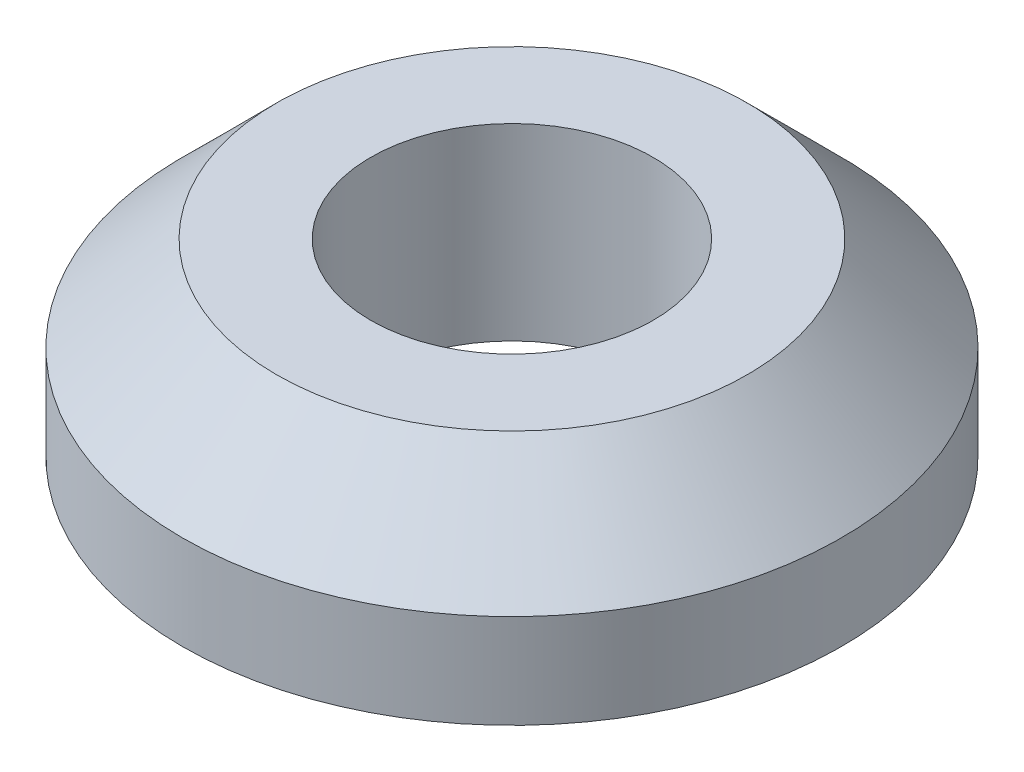
ISO-10303-21;
HEADER;
FILE_DESCRIPTION(('STEP AP214'),'2;1');
FILE_NAME('part.step','',(''),(''),'','','');
FILE_SCHEMA(('AUTOMOTIVE_DESIGN { 1 0 10303 214 1 1 1 1 }'));
ENDSEC;
DATA;
#1=APPLICATION_CONTEXT('core data for automotive mechanical design processes');
#2=APPLICATION_PROTOCOL_DEFINITION('international standard','automotive_design',2000,#1);
#3=PRODUCT_CONTEXT('',#1,'mechanical');
#4=PRODUCT('Part','Part','',(#3));
#5=PRODUCT_RELATED_PRODUCT_CATEGORY('part','',(#4));
#6=PRODUCT_DEFINITION_FORMATION('','',#4);
#7=PRODUCT_DEFINITION_CONTEXT('part definition',#1,'design');
#8=PRODUCT_DEFINITION('design','',#6,#7);
#9=PRODUCT_DEFINITION_SHAPE('','',#8);
#10=(LENGTH_UNIT() NAMED_UNIT(*) SI_UNIT(.MILLI.,.METRE.));
#11=(NAMED_UNIT(*) PLANE_ANGLE_UNIT() SI_UNIT($,.RADIAN.));
#12=(NAMED_UNIT(*) SI_UNIT($,.STERADIAN.) SOLID_ANGLE_UNIT());
#13=UNCERTAINTY_MEASURE_WITH_UNIT(LENGTH_MEASURE(1.E-05),#10,'distance_accuracy_value','');
#14=(GEOMETRIC_REPRESENTATION_CONTEXT(3) GLOBAL_UNCERTAINTY_ASSIGNED_CONTEXT((#13)) GLOBAL_UNIT_ASSIGNED_CONTEXT((#10,
#11,#12)) REPRESENTATION_CONTEXT('',''));
#15=CARTESIAN_POINT('',(0.,0.,0.));
#16=DIRECTION('',(0.,0.,1.));
#17=DIRECTION('',(1.,0.,0.));
#18=AXIS2_PLACEMENT_3D('',#15,#16,#17);
#19=CARTESIAN_POINT('',(0.,2.,0.));
#20=DIRECTION('',(0.,-1.,0.));
#21=DIRECTION('',(0.,0.,-1.));
#22=AXIS2_PLACEMENT_3D('',#19,#20,#21);
#23=CYLINDRICAL_SURFACE('',#22,3.5);
#24=CARTESIAN_POINT('',(0.,0.999999999999994,0.));
#25=DIRECTION('',(0.,1.,0.));
#26=DIRECTION('',(0.,0.,1.));
#27=AXIS2_PLACEMENT_3D('',#24,#25,#26);
#28=CIRCLE('',#27,3.5);
#29=CARTESIAN_POINT('',(0.,0.999999999999994,3.5));
#30=VERTEX_POINT('',#29);
#31=EDGE_CURVE('E10',#30,#30,#28,.F.);
#32=ORIENTED_EDGE('',*,*,#31,.T.);
#33=EDGE_LOOP('',(#32));
#34=FACE_BOUND('',#33,.T.);
#35=CARTESIAN_POINT('',(0.,0.,0.));
#36=DIRECTION('',(0.,1.,0.));
#37=DIRECTION('',(0.,0.,1.));
#38=AXIS2_PLACEMENT_3D('',#35,#36,#37);
#39=CIRCLE('',#38,3.5);
#40=CARTESIAN_POINT('',(0.,0.,3.5));
#41=VERTEX_POINT('',#40);
#42=EDGE_CURVE('E53',#41,#41,#39,.T.);
#43=ORIENTED_EDGE('',*,*,#42,.T.);
#44=EDGE_LOOP('',(#43));
#45=FACE_BOUND('',#44,.T.);
#46=ADVANCED_FACE('F39',(#34,#45),#23,.T.);
#47=CARTESIAN_POINT('',(0.,2.,0.));
#48=DIRECTION('',(0.,1.,0.));
#49=DIRECTION('',(0.,0.,1.));
#50=AXIS2_PLACEMENT_3D('',#47,#48,#49);
#51=PLANE('',#50);
#52=CARTESIAN_POINT('',(0.,2.,0.));
#53=DIRECTION('',(0.,1.,0.));
#54=DIRECTION('',(0.,0.,1.));
#55=AXIS2_PLACEMENT_3D('',#52,#53,#54);
#56=CIRCLE('',#55,1.5);
#57=CARTESIAN_POINT('',(0.,2.,1.5));
#58=VERTEX_POINT('',#57);
#59=EDGE_CURVE('E61',#58,#58,#56,.T.);
#60=ORIENTED_EDGE('',*,*,#59,.F.);
#61=EDGE_LOOP('',(#60));
#62=FACE_BOUND('',#61,.T.);
#63=CARTESIAN_POINT('',(0.,2.,0.));
#64=DIRECTION('',(0.,1.,0.));
#65=DIRECTION('',(0.,0.,1.));
#66=AXIS2_PLACEMENT_3D('',#63,#64,#65);
#67=CIRCLE('',#66,2.5);
#68=CARTESIAN_POINT('',(0.,2.,2.5));
#69=VERTEX_POINT('',#68);
#70=EDGE_CURVE('E48',#69,#69,#67,.T.);
#71=ORIENTED_EDGE('',*,*,#70,.T.);
#72=EDGE_LOOP('',(#71));
#73=FACE_BOUND('',#72,.T.);
#74=ADVANCED_FACE('F78',(#62,#73),#51,.T.);
#75=CARTESIAN_POINT('',(0.,0.,0.));
#76=DIRECTION('',(0.,1.,0.));
#77=DIRECTION('',(0.,0.,1.));
#78=AXIS2_PLACEMENT_3D('',#75,#76,#77);
#79=PLANE('',#78);
#80=CARTESIAN_POINT('',(0.,0.,0.));
#81=DIRECTION('',(0.,1.,0.));
#82=DIRECTION('',(0.,0.,1.));
#83=AXIS2_PLACEMENT_3D('',#80,#81,#82);
#84=CIRCLE('',#83,1.5);
#85=CARTESIAN_POINT('',(0.,0.,1.5));
#86=VERTEX_POINT('',#85);
#87=EDGE_CURVE('E58',#86,#86,#84,.T.);
#88=ORIENTED_EDGE('',*,*,#87,.T.);
#89=EDGE_LOOP('',(#88));
#90=FACE_BOUND('',#89,.T.);
#91=ORIENTED_EDGE('',*,*,#42,.F.);
#92=EDGE_LOOP('',(#91));
#93=FACE_BOUND('',#92,.T.);
#94=ADVANCED_FACE('F69',(#90,#93),#79,.F.);
#95=CARTESIAN_POINT('',(0.,2.,0.));
#96=DIRECTION('',(0.,-1.,0.));
#97=DIRECTION('',(0.,0.,-1.));
#98=AXIS2_PLACEMENT_3D('',#95,#96,#97);
#99=CONICAL_SURFACE('',#98,2.5,0.785398163397447);
#100=ORIENTED_EDGE('',*,*,#31,.F.);
#101=EDGE_LOOP('',(#100));
#102=FACE_BOUND('',#101,.T.);
#103=ORIENTED_EDGE('',*,*,#70,.F.);
#104=EDGE_LOOP('',(#103));
#105=FACE_BOUND('',#104,.T.);
#106=ADVANCED_FACE('F42',(#102,#105),#99,.T.);
#107=CARTESIAN_POINT('',(0.,0.,0.));
#108=DIRECTION('',(0.,1.,0.));
#109=DIRECTION('',(0.,0.,1.));
#110=AXIS2_PLACEMENT_3D('',#107,#108,#109);
#111=CYLINDRICAL_SURFACE('',#110,1.5);
#112=ORIENTED_EDGE('',*,*,#87,.F.);
#113=EDGE_LOOP('',(#112));
#114=FACE_BOUND('',#113,.T.);
#115=ORIENTED_EDGE('',*,*,#59,.T.);
#116=EDGE_LOOP('',(#115));
#117=FACE_BOUND('',#116,.T.);
#118=ADVANCED_FACE('F72',(#114,#117),#111,.F.);
#119=CLOSED_SHELL('',(#46,#74,#94,#106,#118));
#120=MANIFOLD_SOLID_BREP('B2',#119);
#121=ADVANCED_BREP_SHAPE_REPRESENTATION('',(#18,#120),#14);
#122=SHAPE_DEFINITION_REPRESENTATION(#9,#121);
ENDSEC;
END-ISO-10303-21;
